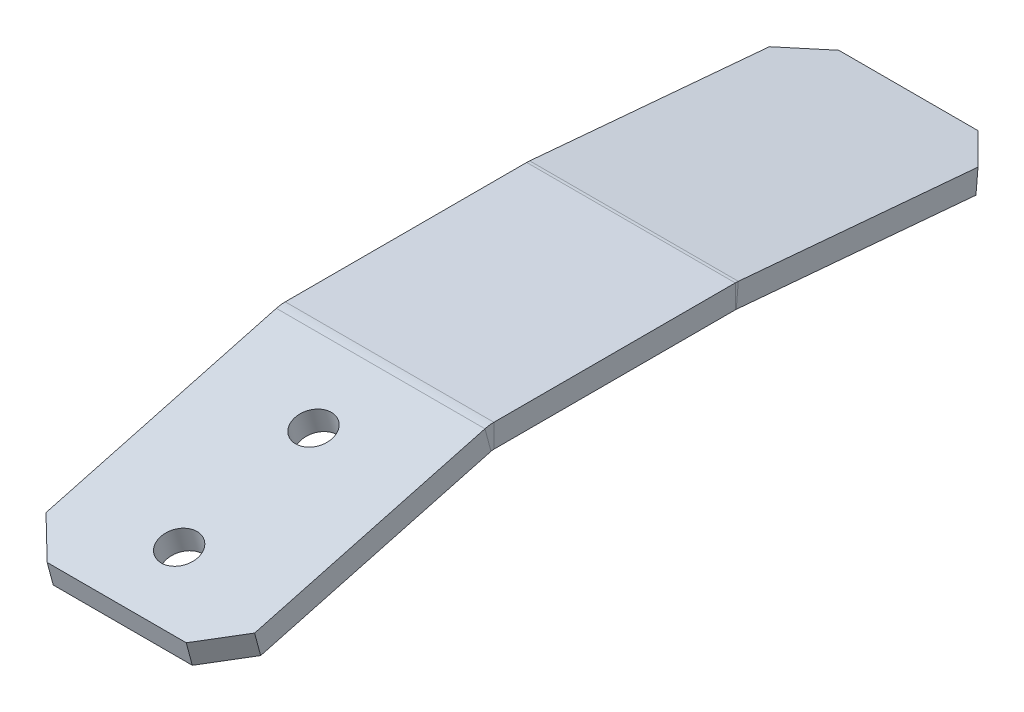
ISO-10303-21;
HEADER;
FILE_DESCRIPTION(('STEP AP214'),'2;1');
FILE_NAME('part.step','',(''),(''),'','','');
FILE_SCHEMA(('AUTOMOTIVE_DESIGN { 1 0 10303 214 1 1 1 1 }'));
ENDSEC;
DATA;
#1=APPLICATION_CONTEXT('core data for automotive mechanical design processes');
#2=APPLICATION_PROTOCOL_DEFINITION('international standard','automotive_design',2000,#1);
#3=PRODUCT_CONTEXT('',#1,'mechanical');
#4=PRODUCT('Part','Part','',(#3));
#5=PRODUCT_RELATED_PRODUCT_CATEGORY('part','',(#4));
#6=PRODUCT_DEFINITION_FORMATION('','',#4);
#7=PRODUCT_DEFINITION_CONTEXT('part definition',#1,'design');
#8=PRODUCT_DEFINITION('design','',#6,#7);
#9=PRODUCT_DEFINITION_SHAPE('','',#8);
#10=(LENGTH_UNIT() NAMED_UNIT(*) SI_UNIT(.MILLI.,.METRE.));
#11=(NAMED_UNIT(*) PLANE_ANGLE_UNIT() SI_UNIT($,.RADIAN.));
#12=(NAMED_UNIT(*) SI_UNIT($,.STERADIAN.) SOLID_ANGLE_UNIT());
#13=UNCERTAINTY_MEASURE_WITH_UNIT(LENGTH_MEASURE(1.E-05),#10,'distance_accuracy_value','');
#14=(GEOMETRIC_REPRESENTATION_CONTEXT(3) GLOBAL_UNCERTAINTY_ASSIGNED_CONTEXT((#13)) GLOBAL_UNIT_ASSIGNED_CONTEXT((#10,
#11,#12)) REPRESENTATION_CONTEXT('',''));
#15=CARTESIAN_POINT('',(0.,0.,0.));
#16=DIRECTION('',(0.,0.,1.));
#17=DIRECTION('',(1.,0.,0.));
#18=AXIS2_PLACEMENT_3D('',#15,#16,#17);
#19=CARTESIAN_POINT('',(0.,-4.2672,0.));
#20=DIRECTION('',(0.,-1.,0.));
#21=DIRECTION('',(0.,0.,-1.));
#22=AXIS2_PLACEMENT_3D('',#19,#20,#21);
#23=PLANE('',#22);
#24=DIRECTION('',(0.,0.,1.));
#25=VECTOR('',#24,1.);
#26=CARTESIAN_POINT('',(-19.0499999999999,-4.2672,-22.225));
#27=LINE('',#26,#25);
#28=CARTESIAN_POINT('',(-19.05,-4.2672,-22.1362809640099));
#29=VERTEX_POINT('',#28);
#30=CARTESIAN_POINT('',(-19.0499999999999,-4.2672,21.9574821249024));
#31=VERTEX_POINT('',#30);
#32=EDGE_CURVE('E262',#29,#31,#27,.T.);
#33=ORIENTED_EDGE('',*,*,#32,.F.);
#34=DIRECTION('',(1.,0.,0.));
#35=VECTOR('',#34,1.);
#36=CARTESIAN_POINT('',(19.05,-4.26719999999931,-22.1362809640099));
#37=LINE('',#36,#35);
#38=CARTESIAN_POINT('',(19.05,-4.26719999999931,-22.1362809640099));
#39=VERTEX_POINT('',#38);
#40=EDGE_CURVE('E202',#39,#29,#37,.F.);
#41=ORIENTED_EDGE('',*,*,#40,.F.);
#42=DIRECTION('',(0.,0.,-1.));
#43=VECTOR('',#42,1.);
#44=CARTESIAN_POINT('',(19.05,-4.2672,-22.225));
#45=LINE('',#44,#43);
#46=CARTESIAN_POINT('',(19.05,-4.2672,21.9574821249024));
#47=VERTEX_POINT('',#46);
#48=EDGE_CURVE('E264',#47,#39,#45,.T.);
#49=ORIENTED_EDGE('',*,*,#48,.F.);
#50=DIRECTION('',(-1.,0.,0.));
#51=VECTOR('',#50,1.);
#52=CARTESIAN_POINT('',(-19.05,-4.26720000000008,21.9574821249024));
#53=LINE('',#52,#51);
#54=EDGE_CURVE('E251',#31,#47,#53,.F.);
#55=ORIENTED_EDGE('',*,*,#54,.F.);
#56=EDGE_LOOP('',(#33,#41,#49,#55));
#57=FACE_BOUND('',#56,.T.);
#58=ADVANCED_FACE('F38',(#57),#23,.T.);
#59=CARTESIAN_POINT('',(0.,0.,0.));
#60=DIRECTION('',(0.,-1.,0.));
#61=DIRECTION('',(0.,0.,-1.));
#62=AXIS2_PLACEMENT_3D('',#59,#60,#61);
#63=PLANE('',#62);
#64=DIRECTION('',(1.,0.,0.));
#65=VECTOR('',#64,1.);
#66=CARTESIAN_POINT('',(19.0499999999999,6.86950496486816E-13,-22.1362809640099));
#67=LINE('',#66,#65);
#68=CARTESIAN_POINT('',(19.0499999999999,6.86950496486816E-13,-22.1362809640099));
#69=VERTEX_POINT('',#68);
#70=CARTESIAN_POINT('',(-19.05,0.,-22.1362809640099));
#71=VERTEX_POINT('',#70);
#72=EDGE_CURVE('E163',#69,#71,#67,.F.);
#73=ORIENTED_EDGE('',*,*,#72,.T.);
#74=DIRECTION('',(0.,0.,1.));
#75=VECTOR('',#74,1.);
#76=CARTESIAN_POINT('',(-19.0499999999999,0.,-22.225));
#77=LINE('',#76,#75);
#78=CARTESIAN_POINT('',(-19.05,0.,21.9574821249024));
#79=VERTEX_POINT('',#78);
#80=EDGE_CURVE('E259',#71,#79,#77,.T.);
#81=ORIENTED_EDGE('',*,*,#80,.T.);
#82=DIRECTION('',(-1.,0.,0.));
#83=VECTOR('',#82,1.);
#84=CARTESIAN_POINT('',(-19.05,0.,21.9574821249024));
#85=LINE('',#84,#83);
#86=CARTESIAN_POINT('',(19.05,0.,21.9574821249024));
#87=VERTEX_POINT('',#86);
#88=EDGE_CURVE('E239',#79,#87,#85,.F.);
#89=ORIENTED_EDGE('',*,*,#88,.T.);
#90=DIRECTION('',(0.,0.,-1.));
#91=VECTOR('',#90,1.);
#92=CARTESIAN_POINT('',(19.05,0.,-22.225));
#93=LINE('',#92,#91);
#94=EDGE_CURVE('E265',#87,#69,#93,.T.);
#95=ORIENTED_EDGE('',*,*,#94,.T.);
#96=EDGE_LOOP('',(#73,#81,#89,#95));
#97=FACE_BOUND('',#96,.T.);
#98=ADVANCED_FACE('F407',(#97),#63,.F.);
#99=CARTESIAN_POINT('',(19.05,-4.2672,-22.225));
#100=DIRECTION('',(1.,0.,0.));
#101=DIRECTION('',(0.,0.,-1.));
#102=AXIS2_PLACEMENT_3D('',#99,#100,#101);
#103=PLANE('',#102);
#104=ORIENTED_EDGE('',*,*,#48,.T.);
#105=DIRECTION('',(0.,1.,0.));
#106=VECTOR('',#105,1.);
#107=CARTESIAN_POINT('',(19.05,-4.26719999999931,-22.1362809640099));
#108=LINE('',#107,#106);
#109=EDGE_CURVE('E198',#39,#69,#108,.T.);
#110=ORIENTED_EDGE('',*,*,#109,.T.);
#111=ORIENTED_EDGE('',*,*,#94,.F.);
#112=DIRECTION('',(0.,1.,0.));
#113=VECTOR('',#112,1.);
#114=CARTESIAN_POINT('',(19.0500000000001,-4.2672,21.9574821249024));
#115=LINE('',#114,#113);
#116=EDGE_CURVE('E256',#47,#87,#115,.T.);
#117=ORIENTED_EDGE('',*,*,#116,.F.);
#118=EDGE_LOOP('',(#104,#110,#111,#117));
#119=FACE_BOUND('',#118,.T.);
#120=ADVANCED_FACE('F391',(#119),#103,.T.);
#121=CARTESIAN_POINT('',(-19.0499999999999,-4.2672,-22.225));
#122=DIRECTION('',(-1.,0.,0.));
#123=DIRECTION('',(0.,0.,1.));
#124=AXIS2_PLACEMENT_3D('',#121,#122,#123);
#125=PLANE('',#124);
#126=DIRECTION('',(0.,1.,0.));
#127=VECTOR('',#126,1.);
#128=CARTESIAN_POINT('',(-19.05,-4.2672,-22.1362809640099));
#129=LINE('',#128,#127);
#130=EDGE_CURVE('E206',#29,#71,#129,.T.);
#131=ORIENTED_EDGE('',*,*,#130,.F.);
#132=ORIENTED_EDGE('',*,*,#32,.T.);
#133=DIRECTION('',(0.,1.,0.));
#134=VECTOR('',#133,1.);
#135=CARTESIAN_POINT('',(-19.05,-4.26720000000008,21.9574821249024));
#136=LINE('',#135,#134);
#137=EDGE_CURVE('E245',#31,#79,#136,.T.);
#138=ORIENTED_EDGE('',*,*,#137,.T.);
#139=ORIENTED_EDGE('',*,*,#80,.F.);
#140=EDGE_LOOP('',(#131,#132,#138,#139));
#141=FACE_BOUND('',#140,.T.);
#142=ADVANCED_FACE('F386',(#141),#125,.T.);
#143=CARTESIAN_POINT('',(19.0500000000001,-6.29919999999995,21.9574821249024));
#144=DIRECTION('',(1.,0.,0.));
#145=DIRECTION('',(0.,1.,0.));
#146=AXIS2_PLACEMENT_3D('',#143,#144,#145);
#147=PLANE('',#146);
#148=DIRECTION('',(0.,0.96592582628907,0.258819045102514));
#149=VECTOR('',#148,1.);
#150=CARTESIAN_POINT('',(19.0500000000001,-4.33643872098061,22.4834024245507));
#151=LINE('',#150,#149);
#152=CARTESIAN_POINT('',(19.0500000000001,-4.33643872098061,22.4834024245507));
#153=VERTEX_POINT('',#152);
#154=CARTESIAN_POINT('',(19.0500000000001,-0.21464003503989,23.5878350538121));
#155=VERTEX_POINT('',#154);
#156=EDGE_CURVE('E209',#153,#155,#151,.T.);
#157=ORIENTED_EDGE('',*,*,#156,.F.);
#158=CARTESIAN_POINT('',(19.0500000000001,-6.29919999999995,21.9574821249024));
#159=DIRECTION('',(-1.,0.,0.));
#160=DIRECTION('',(0.,-1.,0.));
#161=AXIS2_PLACEMENT_3D('',#158,#159,#160);
#162=CIRCLE('',#161,2.03199999999994);
#163=EDGE_CURVE('E248',#47,#153,#162,.F.);
#164=ORIENTED_EDGE('',*,*,#163,.F.);
#165=ORIENTED_EDGE('',*,*,#116,.T.);
#166=CARTESIAN_POINT('',(19.0500000000001,-6.29919999999995,21.9574821249024));
#167=DIRECTION('',(-1.,0.,0.));
#168=DIRECTION('',(0.,-1.,0.));
#169=AXIS2_PLACEMENT_3D('',#166,#167,#168);
#170=CIRCLE('',#169,6.29919999999994);
#171=EDGE_CURVE('E241',#87,#155,#170,.F.);
#172=ORIENTED_EDGE('',*,*,#171,.T.);
#173=EDGE_LOOP('',(#157,#164,#165,#172));
#174=FACE_BOUND('',#173,.T.);
#175=ADVANCED_FACE('F363',(#174),#147,.T.);
#176=CARTESIAN_POINT('',(-19.05,-6.29920000000003,21.9574821249024));
#177=DIRECTION('',(1.,0.,0.));
#178=DIRECTION('',(0.,1.,0.));
#179=AXIS2_PLACEMENT_3D('',#176,#177,#178);
#180=PLANE('',#179);
#181=CARTESIAN_POINT('',(-19.05,-6.29920000000003,21.9574821249024));
#182=DIRECTION('',(-1.,0.,0.));
#183=DIRECTION('',(0.,-1.,0.));
#184=AXIS2_PLACEMENT_3D('',#181,#182,#183);
#185=CIRCLE('',#184,2.03199999999994);
#186=CARTESIAN_POINT('',(-19.05,-4.33643872098069,22.4834024245507));
#187=VERTEX_POINT('',#186);
#188=EDGE_CURVE('E232',#187,#31,#185,.T.);
#189=ORIENTED_EDGE('',*,*,#188,.F.);
#190=DIRECTION('',(0.,0.96592582628907,0.258819045102514));
#191=VECTOR('',#190,1.);
#192=CARTESIAN_POINT('',(-19.05,-4.33643872098062,22.4834024245507));
#193=LINE('',#192,#191);
#194=CARTESIAN_POINT('',(-19.05,-0.214640035039896,23.5878350538122));
#195=VERTEX_POINT('',#194);
#196=EDGE_CURVE('E214',#187,#195,#193,.T.);
#197=ORIENTED_EDGE('',*,*,#196,.T.);
#198=CARTESIAN_POINT('',(-19.05,-6.29920000000003,21.9574821249024));
#199=DIRECTION('',(-1.,0.,0.));
#200=DIRECTION('',(0.,-1.,0.));
#201=AXIS2_PLACEMENT_3D('',#198,#199,#200);
#202=CIRCLE('',#201,6.29919999999994);
#203=EDGE_CURVE('E242',#195,#79,#202,.T.);
#204=ORIENTED_EDGE('',*,*,#203,.T.);
#205=ORIENTED_EDGE('',*,*,#137,.F.);
#206=EDGE_LOOP('',(#189,#197,#204,#205));
#207=FACE_BOUND('',#206,.T.);
#208=ADVANCED_FACE('F383',(#207),#180,.F.);
#209=CARTESIAN_POINT('',(-19.05,-6.29920000000003,21.9574821249024));
#210=DIRECTION('',(-1.,0.,0.));
#211=DIRECTION('',(0.,0.96592582628907,0.258819045102515));
#212=AXIS2_PLACEMENT_3D('',#209,#210,#211);
#213=CYLINDRICAL_SURFACE('',#212,6.29919999999994);
#214=ORIENTED_EDGE('',*,*,#88,.F.);
#215=ORIENTED_EDGE('',*,*,#203,.F.);
#216=DIRECTION('',(1.,0.,0.));
#217=VECTOR('',#216,1.);
#218=CARTESIAN_POINT('',(0.,-0.214640035039892,23.5878350538122));
#219=LINE('',#218,#217);
#220=EDGE_CURVE('E217',#195,#155,#219,.T.);
#221=ORIENTED_EDGE('',*,*,#220,.T.);
#222=ORIENTED_EDGE('',*,*,#171,.F.);
#223=EDGE_LOOP('',(#214,#215,#221,#222));
#224=FACE_BOUND('',#223,.T.);
#225=ADVANCED_FACE('F380',(#224),#213,.T.);
#226=CARTESIAN_POINT('',(-19.05,-6.29920000000003,21.9574821249024));
#227=DIRECTION('',(-1.,0.,0.));
#228=DIRECTION('',(0.,0.96592582628907,0.258819045102515));
#229=AXIS2_PLACEMENT_3D('',#226,#227,#228);
#230=CYLINDRICAL_SURFACE('',#229,2.03199999999994);
#231=ORIENTED_EDGE('',*,*,#54,.T.);
#232=ORIENTED_EDGE('',*,*,#163,.T.);
#233=DIRECTION('',(-1.,0.,0.));
#234=VECTOR('',#233,1.);
#235=CARTESIAN_POINT('',(19.0500000000001,-4.33643872098061,22.4834024245507));
#236=LINE('',#235,#234);
#237=EDGE_CURVE('E212',#153,#187,#236,.T.);
#238=ORIENTED_EDGE('',*,*,#237,.T.);
#239=ORIENTED_EDGE('',*,*,#188,.T.);
#240=EDGE_LOOP('',(#231,#232,#238,#239));
#241=FACE_BOUND('',#240,.T.);
#242=ADVANCED_FACE('F367',(#241),#230,.F.);
#243=CARTESIAN_POINT('',(-19.05,-0.14540131405928,23.3294326292614));
#244=DIRECTION('',(1.,0.,0.));
#245=DIRECTION('',(0.,0.,-1.));
#246=AXIS2_PLACEMENT_3D('',#243,#244,#245);
#247=PLANE('',#246);
#248=DIRECTION('',(0.,-0.258819045102515,0.96592582628907));
#249=VECTOR('',#248,1.);
#250=CARTESIAN_POINT('',(-19.05,-4.2672,22.225));
#251=LINE('',#250,#249);
#252=CARTESIAN_POINT('',(-19.05,-15.6094283025085,64.5547722960084));
#253=VERTEX_POINT('',#252);
#254=EDGE_CURVE('E222',#187,#253,#251,.T.);
#255=ORIENTED_EDGE('',*,*,#254,.T.);
#256=DIRECTION('',(0.,0.96592582628907,0.258819045102515));
#257=VECTOR('',#256,1.);
#258=CARTESIAN_POINT('',(-19.05,-11.4876296165678,65.6592049252698));
#259=LINE('',#258,#257);
#260=CARTESIAN_POINT('',(-19.05,-11.4876296165678,65.6592049252698));
#261=VERTEX_POINT('',#260);
#262=EDGE_CURVE('E279',#253,#261,#259,.T.);
#263=ORIENTED_EDGE('',*,*,#262,.T.);
#264=DIRECTION('',(0.,-0.258819045102515,0.96592582628907));
#265=VECTOR('',#264,1.);
#266=CARTESIAN_POINT('',(-19.05,-0.14540131405928,23.3294326292614));
#267=LINE('',#266,#265);
#268=EDGE_CURVE('E223',#195,#261,#267,.T.);
#269=ORIENTED_EDGE('',*,*,#268,.F.);
#270=ORIENTED_EDGE('',*,*,#196,.F.);
#271=EDGE_LOOP('',(#255,#263,#269,#270));
#272=FACE_BOUND('',#271,.T.);
#273=ADVANCED_FACE('F373',(#272),#247,.F.);
#274=CARTESIAN_POINT('',(19.0500000000001,-0.145401314059278,23.3294326292614));
#275=DIRECTION('',(-1.,0.,0.));
#276=DIRECTION('',(0.,0.,1.));
#277=AXIS2_PLACEMENT_3D('',#274,#275,#276);
#278=PLANE('',#277);
#279=DIRECTION('',(0.,0.258819045102515,-0.96592582628907));
#280=VECTOR('',#279,1.);
#281=CARTESIAN_POINT('',(19.0500000000001,-0.145401314059278,23.3294326292614));
#282=LINE('',#281,#280);
#283=CARTESIAN_POINT('',(19.05,-11.4876296165677,65.6592049252698));
#284=VERTEX_POINT('',#283);
#285=EDGE_CURVE('E230',#284,#155,#282,.T.);
#286=ORIENTED_EDGE('',*,*,#285,.F.);
#287=DIRECTION('',(0.,-0.96592582628907,-0.258819045102515));
#288=VECTOR('',#287,1.);
#289=CARTESIAN_POINT('',(19.05,-11.4876296165678,65.6592049252698));
#290=LINE('',#289,#288);
#291=CARTESIAN_POINT('',(19.05,-15.6094283025085,64.5547722960084));
#292=VERTEX_POINT('',#291);
#293=EDGE_CURVE('E11',#284,#292,#290,.T.);
#294=ORIENTED_EDGE('',*,*,#293,.T.);
#295=DIRECTION('',(0.,0.258819045102515,-0.96592582628907));
#296=VECTOR('',#295,1.);
#297=CARTESIAN_POINT('',(19.0500000000001,-4.2672,22.225));
#298=LINE('',#297,#296);
#299=EDGE_CURVE('E227',#292,#153,#298,.T.);
#300=ORIENTED_EDGE('',*,*,#299,.T.);
#301=ORIENTED_EDGE('',*,*,#156,.T.);
#302=EDGE_LOOP('',(#286,#294,#300,#301));
#303=FACE_BOUND('',#302,.T.);
#304=ADVANCED_FACE('F359',(#303),#278,.F.);
#305=CARTESIAN_POINT('',(0.,5.6966968844261,1.52642532970683));
#306=DIRECTION('',(0.,-0.96592582628907,-0.258819045102515));
#307=DIRECTION('',(0.,0.258819045102515,-0.96592582628907));
#308=AXIS2_PLACEMENT_3D('',#305,#306,#307);
#309=PLANE('',#308);
#310=CARTESIAN_POINT('',(0.,-3.50164190784186,35.8550930476835));
#311=DIRECTION('',(0.,0.96592582628907,0.258819045102515));
#312=DIRECTION('',(0.,-0.258819045102515,0.96592582628907));
#313=AXIS2_PLACEMENT_3D('',#310,#311,#312);
#314=CIRCLE('',#313,3.373501);
#315=CARTESIAN_POINT('',(0.,-4.37476821531424,39.1136447885955));
#316=VERTEX_POINT('',#315);
#317=EDGE_CURVE('E328',#316,#316,#314,.T.);
#318=ORIENTED_EDGE('',*,*,#317,.F.);
#319=EDGE_LOOP('',(#318));
#320=FACE_BOUND('',#319,.T.);
#321=CARTESIAN_POINT('',(0.,-10.0756456534457,60.3896090354258));
#322=DIRECTION('',(0.,0.96592582628907,0.258819045102515));
#323=DIRECTION('',(0.,-0.258819045102515,0.96592582628907));
#324=AXIS2_PLACEMENT_3D('',#321,#322,#323);
#325=CIRCLE('',#324,3.373501);
#326=CARTESIAN_POINT('',(0.,-10.9487719609181,63.6481607763379));
#327=VERTEX_POINT('',#326);
#328=EDGE_CURVE('E325',#327,#327,#325,.T.);
#329=ORIENTED_EDGE('',*,*,#328,.F.);
#330=EDGE_LOOP('',(#329));
#331=FACE_BOUND('',#330,.T.);
#332=ORIENTED_EDGE('',*,*,#268,.T.);
#333=DIRECTION('',(-0.707106781186547,0.183012701892215,-0.683012701892221));
#334=VECTOR('',#333,1.);
#335=CARTESIAN_POINT('',(-12.7,-13.1311305529687,71.7928339222054));
#336=LINE('',#335,#334);
#337=CARTESIAN_POINT('',(-12.7,-13.1311305529687,71.7928339222054));
#338=VERTEX_POINT('',#337);
#339=EDGE_CURVE('E283',#261,#338,#336,.F.);
#340=ORIENTED_EDGE('',*,*,#339,.T.);
#341=DIRECTION('',(1.,0.,0.));
#342=VECTOR('',#341,1.);
#343=CARTESIAN_POINT('',(19.05,-13.1311305529687,71.7928339222054));
#344=LINE('',#343,#342);
#345=CARTESIAN_POINT('',(12.7,-13.1311305529687,71.7928339222054));
#346=VERTEX_POINT('',#345);
#347=EDGE_CURVE('E226',#338,#346,#344,.T.);
#348=ORIENTED_EDGE('',*,*,#347,.T.);
#349=DIRECTION('',(-0.707106781186551,-0.183012701892214,0.683012701892218));
#350=VECTOR('',#349,1.);
#351=CARTESIAN_POINT('',(19.05,-11.4876296165678,65.6592049252698));
#352=LINE('',#351,#350);
#353=EDGE_CURVE('E281',#346,#284,#352,.F.);
#354=ORIENTED_EDGE('',*,*,#353,.T.);
#355=ORIENTED_EDGE('',*,*,#285,.T.);
#356=ORIENTED_EDGE('',*,*,#220,.F.);
#357=EDGE_LOOP('',(#332,#340,#348,#354,#355,#356));
#358=FACE_BOUND('',#357,.T.);
#359=ADVANCED_FACE('F341',(#320,#331,#358),#309,.F.);
#360=CARTESIAN_POINT('',(0.,1.57489819848537,0.421992700445375));
#361=DIRECTION('',(0.,-0.96592582628907,-0.258819045102515));
#362=DIRECTION('',(0.,0.258819045102515,-0.96592582628907));
#363=AXIS2_PLACEMENT_3D('',#360,#361,#362);
#364=PLANE('',#363);
#365=CARTESIAN_POINT('',(0.,-7.62344059378258,34.750660418422));
#366=DIRECTION('',(0.,-0.96592582628907,-0.258819045102515));
#367=DIRECTION('',(0.,0.258819045102515,-0.96592582628907));
#368=AXIS2_PLACEMENT_3D('',#365,#366,#367);
#369=CIRCLE('',#368,3.37350099999999);
#370=CARTESIAN_POINT('',(0.,-6.7503142863102,31.49210867751));
#371=VERTEX_POINT('',#370);
#372=EDGE_CURVE('E42',#371,#371,#369,.T.);
#373=ORIENTED_EDGE('',*,*,#372,.F.);
#374=EDGE_LOOP('',(#373));
#375=FACE_BOUND('',#374,.T.);
#376=CARTESIAN_POINT('',(0.,-14.1974443393864,59.2851764061644));
#377=DIRECTION('',(0.,-0.96592582628907,-0.258819045102515));
#378=DIRECTION('',(0.,0.258819045102515,-0.96592582628907));
#379=AXIS2_PLACEMENT_3D('',#376,#377,#378);
#380=CIRCLE('',#379,3.37350099999999);
#381=CARTESIAN_POINT('',(0.,-13.3243180319141,56.0266246652524));
#382=VERTEX_POINT('',#381);
#383=EDGE_CURVE('E320',#382,#382,#380,.T.);
#384=ORIENTED_EDGE('',*,*,#383,.F.);
#385=EDGE_LOOP('',(#384));
#386=FACE_BOUND('',#385,.T.);
#387=DIRECTION('',(1.,0.,0.));
#388=VECTOR('',#387,1.);
#389=CARTESIAN_POINT('',(19.05,-17.2529292389094,70.688401292944));
#390=LINE('',#389,#388);
#391=CARTESIAN_POINT('',(-12.7,-17.2529292389094,70.688401292944));
#392=VERTEX_POINT('',#391);
#393=CARTESIAN_POINT('',(12.7,-17.2529292389094,70.688401292944));
#394=VERTEX_POINT('',#393);
#395=EDGE_CURVE('E235',#392,#394,#390,.T.);
#396=ORIENTED_EDGE('',*,*,#395,.F.);
#397=DIRECTION('',(0.707106781186547,-0.183012701892215,0.683012701892221));
#398=VECTOR('',#397,1.);
#399=CARTESIAN_POINT('',(-42.722569549388,-9.48251645661299,41.6888259936302));
#400=LINE('',#399,#398);
#401=EDGE_CURVE('E277',#392,#253,#400,.F.);
#402=ORIENTED_EDGE('',*,*,#401,.T.);
#403=ORIENTED_EDGE('',*,*,#254,.F.);
#404=ORIENTED_EDGE('',*,*,#237,.F.);
#405=ORIENTED_EDGE('',*,*,#299,.F.);
#406=DIRECTION('',(0.707106781186551,0.183012701892214,-0.683012701892218));
#407=VECTOR('',#406,1.);
#408=CARTESIAN_POINT('',(42.722569549388,-9.48251645661307,41.6888259936305));
#409=LINE('',#408,#407);
#410=EDGE_CURVE('E275',#292,#394,#409,.F.);
#411=ORIENTED_EDGE('',*,*,#410,.T.);
#412=EDGE_LOOP('',(#396,#402,#403,#404,#405,#411));
#413=FACE_BOUND('',#412,.T.);
#414=ADVANCED_FACE('F337',(#375,#386,#413),#364,.T.);
#415=CARTESIAN_POINT('',(19.05,-13.1311305529687,71.7928339222054));
#416=DIRECTION('',(0.,0.258819045102515,-0.96592582628907));
#417=DIRECTION('',(0.,0.96592582628907,0.258819045102515));
#418=AXIS2_PLACEMENT_3D('',#415,#416,#417);
#419=PLANE('',#418);
#420=ORIENTED_EDGE('',*,*,#347,.F.);
#421=DIRECTION('',(0.,-0.96592582628907,-0.258819045102515));
#422=VECTOR('',#421,1.);
#423=CARTESIAN_POINT('',(-12.7,-13.1311305529687,71.7928339222054));
#424=LINE('',#423,#422);
#425=EDGE_CURVE('E272',#338,#392,#424,.T.);
#426=ORIENTED_EDGE('',*,*,#425,.T.);
#427=ORIENTED_EDGE('',*,*,#395,.T.);
#428=DIRECTION('',(0.,0.96592582628907,0.258819045102515));
#429=VECTOR('',#428,1.);
#430=CARTESIAN_POINT('',(12.7,-13.1311305529687,71.7928339222054));
#431=LINE('',#430,#429);
#432=EDGE_CURVE('E268',#394,#346,#431,.T.);
#433=ORIENTED_EDGE('',*,*,#432,.T.);
#434=EDGE_LOOP('',(#420,#426,#427,#433));
#435=FACE_BOUND('',#434,.T.);
#436=ADVANCED_FACE('F340',(#435),#419,.F.);
#437=CARTESIAN_POINT('',(-19.05,-6.2992000000005,-22.1362809640099));
#438=DIRECTION('',(-1.,0.,0.));
#439=DIRECTION('',(0.,-1.,0.));
#440=AXIS2_PLACEMENT_3D('',#437,#438,#439);
#441=PLANE('',#440);
#442=DIRECTION('',(0.,0.996194698091746,-0.0871557427476516));
#443=VECTOR('',#442,1.);
#444=CARTESIAN_POINT('',(-19.05,-4.27493237347757,-22.3133814332732));
#445=LINE('',#444,#443);
#446=CARTESIAN_POINT('',(-19.05,-4.27493237347757,-22.3133814332732));
#447=VERTEX_POINT('',#446);
#448=CARTESIAN_POINT('',(-19.0500000000001,-0.0239703577804709,-22.6852924187259));
#449=VERTEX_POINT('',#448);
#450=EDGE_CURVE('E308',#447,#449,#445,.T.);
#451=ORIENTED_EDGE('',*,*,#450,.F.);
#452=CARTESIAN_POINT('',(-19.05,-6.2992000000005,-22.1362809640099));
#453=DIRECTION('',(1.,0.,0.));
#454=DIRECTION('',(0.,1.,0.));
#455=AXIS2_PLACEMENT_3D('',#452,#453,#454);
#456=CIRCLE('',#455,2.0320000000005);
#457=EDGE_CURVE('E166',#29,#447,#456,.F.);
#458=ORIENTED_EDGE('',*,*,#457,.F.);
#459=ORIENTED_EDGE('',*,*,#130,.T.);
#460=CARTESIAN_POINT('',(-19.05,-6.2992000000005,-22.1362809640099));
#461=DIRECTION('',(1.,0.,0.));
#462=DIRECTION('',(0.,1.,0.));
#463=AXIS2_PLACEMENT_3D('',#460,#461,#462);
#464=CIRCLE('',#463,6.2992000000005);
#465=EDGE_CURVE('E197',#71,#449,#464,.F.);
#466=ORIENTED_EDGE('',*,*,#465,.T.);
#467=EDGE_LOOP('',(#451,#458,#459,#466));
#468=FACE_BOUND('',#467,.T.);
#469=ADVANCED_FACE('F396',(#468),#441,.T.);
#470=CARTESIAN_POINT('',(19.05,-6.29919999999982,-22.1362809640099));
#471=DIRECTION('',(-1.,0.,0.));
#472=DIRECTION('',(0.,-1.,0.));
#473=AXIS2_PLACEMENT_3D('',#470,#471,#472);
#474=PLANE('',#473);
#475=CARTESIAN_POINT('',(19.05,-6.29919999999982,-22.1362809640099));
#476=DIRECTION('',(1.,0.,0.));
#477=DIRECTION('',(0.,1.,0.));
#478=AXIS2_PLACEMENT_3D('',#475,#476,#477);
#479=CIRCLE('',#478,2.0320000000005);
#480=CARTESIAN_POINT('',(19.05,-4.27493237347689,-22.3133814332732));
#481=VERTEX_POINT('',#480);
#482=EDGE_CURVE('E173',#481,#39,#479,.T.);
#483=ORIENTED_EDGE('',*,*,#482,.F.);
#484=DIRECTION('',(0.,0.996194698091746,-0.0871557427476516));
#485=VECTOR('',#484,1.);
#486=CARTESIAN_POINT('',(19.05,-4.27493237347757,-22.3133814332731));
#487=LINE('',#486,#485);
#488=CARTESIAN_POINT('',(19.05,-0.0239703577804666,-22.6852924187259));
#489=VERTEX_POINT('',#488);
#490=EDGE_CURVE('E170',#481,#489,#487,.T.);
#491=ORIENTED_EDGE('',*,*,#490,.T.);
#492=CARTESIAN_POINT('',(19.05,-6.29919999999982,-22.1362809640099));
#493=DIRECTION('',(1.,0.,0.));
#494=DIRECTION('',(0.,1.,0.));
#495=AXIS2_PLACEMENT_3D('',#492,#493,#494);
#496=CIRCLE('',#495,6.2992000000005);
#497=EDGE_CURVE('E156',#489,#69,#496,.T.);
#498=ORIENTED_EDGE('',*,*,#497,.T.);
#499=ORIENTED_EDGE('',*,*,#109,.F.);
#500=EDGE_LOOP('',(#483,#491,#498,#499));
#501=FACE_BOUND('',#500,.T.);
#502=ADVANCED_FACE('F171',(#501),#474,.F.);
#503=CARTESIAN_POINT('',(19.05,-6.29919999999982,-22.1362809640099));
#504=DIRECTION('',(1.,0.,0.));
#505=DIRECTION('',(0.,0.996194698091746,-0.0871557427476516));
#506=AXIS2_PLACEMENT_3D('',#503,#504,#505);
#507=CYLINDRICAL_SURFACE('',#506,6.2992000000005);
#508=ORIENTED_EDGE('',*,*,#72,.F.);
#509=ORIENTED_EDGE('',*,*,#497,.F.);
#510=DIRECTION('',(-1.,0.,0.));
#511=VECTOR('',#510,1.);
#512=CARTESIAN_POINT('',(0.,-0.0239703577804692,-22.6852924187259));
#513=LINE('',#512,#511);
#514=EDGE_CURVE('E161',#489,#449,#513,.T.);
#515=ORIENTED_EDGE('',*,*,#514,.T.);
#516=ORIENTED_EDGE('',*,*,#465,.F.);
#517=EDGE_LOOP('',(#508,#509,#515,#516));
#518=FACE_BOUND('',#517,.T.);
#519=ADVANCED_FACE('F158',(#518),#507,.T.);
#520=CARTESIAN_POINT('',(19.05,-6.29919999999982,-22.1362809640099));
#521=DIRECTION('',(1.,0.,0.));
#522=DIRECTION('',(0.,0.996194698091746,-0.0871557427476516));
#523=AXIS2_PLACEMENT_3D('',#520,#521,#522);
#524=CYLINDRICAL_SURFACE('',#523,2.0320000000005);
#525=ORIENTED_EDGE('',*,*,#40,.T.);
#526=ORIENTED_EDGE('',*,*,#457,.T.);
#527=DIRECTION('',(1.,0.,0.));
#528=VECTOR('',#527,1.);
#529=CARTESIAN_POINT('',(-19.05,-4.27493237347757,-22.3133814332732));
#530=LINE('',#529,#528);
#531=EDGE_CURVE('E175',#447,#481,#530,.T.);
#532=ORIENTED_EDGE('',*,*,#531,.T.);
#533=ORIENTED_EDGE('',*,*,#482,.T.);
#534=EDGE_LOOP('',(#525,#526,#532,#533));
#535=FACE_BOUND('',#534,.T.);
#536=ADVANCED_FACE('F393',(#535),#524,.F.);
#537=CARTESIAN_POINT('',(-19.05,-4.40743498924534,-72.7885224236777));
#538=DIRECTION('',(1.,0.,0.));
#539=DIRECTION('',(0.,0.,-1.));
#540=AXIS2_PLACEMENT_3D('',#537,#538,#539);
#541=PLANE('',#540);
#542=DIRECTION('',(0.,0.0871557427476516,0.996194698091746));
#543=VECTOR('',#542,1.);
#544=CARTESIAN_POINT('',(-19.05,-4.40743498924534,-72.7885224236777));
#545=LINE('',#544,#543);
#546=CARTESIAN_POINT('',(-19.05,-3.85399602279776,-66.4626860907951));
#547=VERTEX_POINT('',#546);
#548=EDGE_CURVE('E182',#547,#449,#545,.T.);
#549=ORIENTED_EDGE('',*,*,#548,.F.);
#550=DIRECTION('',(0.,-0.996194698091746,0.0871557427476516));
#551=VECTOR('',#550,1.);
#552=CARTESIAN_POINT('',(-19.05,-3.85399602279776,-66.4626860907951));
#553=LINE('',#552,#551);
#554=CARTESIAN_POINT('',(-19.05,-8.10495803849486,-66.0907751053424));
#555=VERTEX_POINT('',#554);
#556=EDGE_CURVE('E285',#547,#555,#553,.T.);
#557=ORIENTED_EDGE('',*,*,#556,.T.);
#558=DIRECTION('',(0.,0.0871557427476516,0.996194698091746));
#559=VECTOR('',#558,1.);
#560=CARTESIAN_POINT('',(-19.05,-8.65839700494244,-72.4166114382249));
#561=LINE('',#560,#559);
#562=EDGE_CURVE('E183',#555,#447,#561,.T.);
#563=ORIENTED_EDGE('',*,*,#562,.T.);
#564=ORIENTED_EDGE('',*,*,#450,.T.);
#565=EDGE_LOOP('',(#549,#557,#563,#564));
#566=FACE_BOUND('',#565,.T.);
#567=ADVANCED_FACE('F305',(#566),#541,.F.);
#568=CARTESIAN_POINT('',(19.05,-4.40743498924534,-72.7885224236777));
#569=DIRECTION('',(-1.,0.,0.));
#570=DIRECTION('',(0.,0.,1.));
#571=AXIS2_PLACEMENT_3D('',#568,#569,#570);
#572=PLANE('',#571);
#573=DIRECTION('',(0.,-0.0871557427476515,-0.996194698091746));
#574=VECTOR('',#573,1.);
#575=CARTESIAN_POINT('',(19.05,-8.65839700494244,-72.4166114382249));
#576=LINE('',#575,#574);
#577=CARTESIAN_POINT('',(19.05,-8.10495803849486,-66.0907751053424));
#578=VERTEX_POINT('',#577);
#579=EDGE_CURVE('E193',#481,#578,#576,.T.);
#580=ORIENTED_EDGE('',*,*,#579,.T.);
#581=DIRECTION('',(0.,0.996194698091746,-0.0871557427476515));
#582=VECTOR('',#581,1.);
#583=CARTESIAN_POINT('',(19.05,-3.85399602279776,-66.4626860907952));
#584=LINE('',#583,#582);
#585=CARTESIAN_POINT('',(19.05,-3.85399602279776,-66.4626860907952));
#586=VERTEX_POINT('',#585);
#587=EDGE_CURVE('E47',#578,#586,#584,.T.);
#588=ORIENTED_EDGE('',*,*,#587,.T.);
#589=DIRECTION('',(0.,-0.0871557427476515,-0.996194698091746));
#590=VECTOR('',#589,1.);
#591=CARTESIAN_POINT('',(19.05,-4.40743498924534,-72.7885224236777));
#592=LINE('',#591,#590);
#593=EDGE_CURVE('E179',#489,#586,#592,.T.);
#594=ORIENTED_EDGE('',*,*,#593,.F.);
#595=ORIENTED_EDGE('',*,*,#490,.F.);
#596=EDGE_LOOP('',(#580,#588,#594,#595));
#597=FACE_BOUND('',#596,.T.);
#598=ADVANCED_FACE('F185',(#597),#572,.F.);
#599=CARTESIAN_POINT('',(0.,1.94584156819387,-0.170239078234457));
#600=DIRECTION('',(0.,-0.996194698091746,0.0871557427476516));
#601=DIRECTION('',(0.,-0.0871557427476516,-0.996194698091746));
#602=AXIS2_PLACEMENT_3D('',#599,#600,#601);
#603=PLANE('',#602);
#604=DIRECTION('',(-1.,0.,0.));
#605=VECTOR('',#604,1.);
#606=CARTESIAN_POINT('',(-19.05,-4.40743498924534,-72.7885224236777));
#607=LINE('',#606,#605);
#608=CARTESIAN_POINT('',(12.7,-4.40743498924534,-72.7885224236777));
#609=VERTEX_POINT('',#608);
#610=CARTESIAN_POINT('',(-12.7,-4.40743498924534,-72.7885224236777));
#611=VERTEX_POINT('',#610);
#612=EDGE_CURVE('E186',#609,#611,#607,.T.);
#613=ORIENTED_EDGE('',*,*,#612,.T.);
#614=DIRECTION('',(0.707106781186549,-0.0616284167162146,-0.704416026402758));
#615=VECTOR('',#614,1.);
#616=CARTESIAN_POINT('',(-19.05,-3.85399602279776,-66.4626860907951));
#617=LINE('',#616,#615);
#618=EDGE_CURVE('E298',#611,#547,#617,.F.);
#619=ORIENTED_EDGE('',*,*,#618,.T.);
#620=ORIENTED_EDGE('',*,*,#548,.T.);
#621=ORIENTED_EDGE('',*,*,#514,.F.);
#622=ORIENTED_EDGE('',*,*,#593,.T.);
#623=DIRECTION('',(0.707106781186547,0.0616284167162148,0.70441602640276));
#624=VECTOR('',#623,1.);
#625=CARTESIAN_POINT('',(12.7,-4.40743498924534,-72.7885224236777));
#626=LINE('',#625,#624);
#627=EDGE_CURVE('E296',#586,#609,#626,.F.);
#628=ORIENTED_EDGE('',*,*,#627,.T.);
#629=EDGE_LOOP('',(#613,#619,#620,#621,#622,#628));
#630=FACE_BOUND('',#629,.T.);
#631=ADVANCED_FACE('F178',(#630),#603,.F.);
#632=CARTESIAN_POINT('',(0.,-2.30512044750323,0.201671907218322));
#633=DIRECTION('',(0.,-0.996194698091746,0.0871557427476516));
#634=DIRECTION('',(0.,-0.0871557427476516,-0.996194698091746));
#635=AXIS2_PLACEMENT_3D('',#632,#633,#634);
#636=PLANE('',#635);
#637=ORIENTED_EDGE('',*,*,#562,.F.);
#638=DIRECTION('',(-0.707106781186549,0.0616284167162146,0.704416026402758));
#639=VECTOR('',#638,1.);
#640=CARTESIAN_POINT('',(-42.7978366952498,-6.03519769267044,-42.4333060983861));
#641=LINE('',#640,#639);
#642=CARTESIAN_POINT('',(-12.7,-8.65839700494244,-72.4166114382249));
#643=VERTEX_POINT('',#642);
#644=EDGE_CURVE('E290',#555,#643,#641,.F.);
#645=ORIENTED_EDGE('',*,*,#644,.T.);
#646=DIRECTION('',(-1.,0.,0.));
#647=VECTOR('',#646,1.);
#648=CARTESIAN_POINT('',(-19.05,-8.65839700494244,-72.4166114382249));
#649=LINE('',#648,#647);
#650=CARTESIAN_POINT('',(12.7,-8.65839700494244,-72.4166114382249));
#651=VERTEX_POINT('',#650);
#652=EDGE_CURVE('E189',#651,#643,#649,.T.);
#653=ORIENTED_EDGE('',*,*,#652,.F.);
#654=DIRECTION('',(-0.707106781186547,-0.0616284167162148,-0.70441602640276));
#655=VECTOR('',#654,1.);
#656=CARTESIAN_POINT('',(42.7978366952498,-6.03519769267042,-42.4333060983858));
#657=LINE('',#656,#655);
#658=EDGE_CURVE('E288',#651,#578,#657,.F.);
#659=ORIENTED_EDGE('',*,*,#658,.T.);
#660=ORIENTED_EDGE('',*,*,#579,.F.);
#661=ORIENTED_EDGE('',*,*,#531,.F.);
#662=EDGE_LOOP('',(#637,#645,#653,#659,#660,#661));
#663=FACE_BOUND('',#662,.T.);
#664=ADVANCED_FACE('F312',(#663),#636,.T.);
#665=CARTESIAN_POINT('',(-19.05,-4.40743498924534,-72.7885224236777));
#666=DIRECTION('',(0.,0.0871557427476516,0.996194698091746));
#667=DIRECTION('',(0.,-0.996194698091746,0.0871557427476516));
#668=AXIS2_PLACEMENT_3D('',#665,#666,#667);
#669=PLANE('',#668);
#670=ORIENTED_EDGE('',*,*,#652,.T.);
#671=DIRECTION('',(0.,0.996194698091746,-0.0871557427476516));
#672=VECTOR('',#671,1.);
#673=CARTESIAN_POINT('',(-12.7,-4.40743498924534,-72.7885224236777));
#674=LINE('',#673,#672);
#675=EDGE_CURVE('E61',#643,#611,#674,.T.);
#676=ORIENTED_EDGE('',*,*,#675,.T.);
#677=ORIENTED_EDGE('',*,*,#612,.F.);
#678=DIRECTION('',(0.,-0.996194698091746,0.0871557427476516));
#679=VECTOR('',#678,1.);
#680=CARTESIAN_POINT('',(12.7,-4.40743498924534,-72.7885224236777));
#681=LINE('',#680,#679);
#682=EDGE_CURVE('E292',#609,#651,#681,.T.);
#683=ORIENTED_EDGE('',*,*,#682,.T.);
#684=EDGE_LOOP('',(#670,#676,#677,#683));
#685=FACE_BOUND('',#684,.T.);
#686=ADVANCED_FACE('F314',(#685),#669,.F.);
#687=CARTESIAN_POINT('',(-12.7,-13.1311305529687,71.7928339222054));
#688=DIRECTION('',(0.707106781186548,0.183012701892215,-0.68301270189222));
#689=DIRECTION('',(0.,-0.96592582628907,-0.258819045102515));
#690=AXIS2_PLACEMENT_3D('',#687,#688,#689);
#691=PLANE('',#690);
#692=ORIENTED_EDGE('',*,*,#339,.F.);
#693=ORIENTED_EDGE('',*,*,#262,.F.);
#694=ORIENTED_EDGE('',*,*,#401,.F.);
#695=ORIENTED_EDGE('',*,*,#425,.F.);
#696=EDGE_LOOP('',(#692,#693,#694,#695));
#697=FACE_BOUND('',#696,.T.);
#698=ADVANCED_FACE('F377',(#697),#691,.F.);
#699=CARTESIAN_POINT('',(-19.05,-3.85399602279776,-66.4626860907951));
#700=DIRECTION('',(0.707106781186546,0.0616284167162148,0.704416026402761));
#701=DIRECTION('',(0.,-0.996194698091746,0.0871557427476516));
#702=AXIS2_PLACEMENT_3D('',#699,#700,#701);
#703=PLANE('',#702);
#704=ORIENTED_EDGE('',*,*,#618,.F.);
#705=ORIENTED_EDGE('',*,*,#675,.F.);
#706=ORIENTED_EDGE('',*,*,#644,.F.);
#707=ORIENTED_EDGE('',*,*,#556,.F.);
#708=EDGE_LOOP('',(#704,#705,#706,#707));
#709=FACE_BOUND('',#708,.T.);
#710=ADVANCED_FACE('F309',(#709),#703,.F.);
#711=CARTESIAN_POINT('',(12.7,-4.40743498924534,-72.7885224236777));
#712=DIRECTION('',(-0.707106781186548,0.0616284167162146,0.704416026402758));
#713=DIRECTION('',(0.,-0.996194698091746,0.0871557427476516));
#714=AXIS2_PLACEMENT_3D('',#711,#712,#713);
#715=PLANE('',#714);
#716=ORIENTED_EDGE('',*,*,#627,.F.);
#717=ORIENTED_EDGE('',*,*,#587,.F.);
#718=ORIENTED_EDGE('',*,*,#658,.F.);
#719=ORIENTED_EDGE('',*,*,#682,.F.);
#720=EDGE_LOOP('',(#716,#717,#718,#719));
#721=FACE_BOUND('',#720,.T.);
#722=ADVANCED_FACE('F317',(#721),#715,.F.);
#723=CARTESIAN_POINT('',(19.05,-11.4876296165678,65.6592049252698));
#724=DIRECTION('',(-0.707106781186545,0.183012701892216,-0.683012701892223));
#725=DIRECTION('',(0.,-0.96592582628907,-0.258819045102515));
#726=AXIS2_PLACEMENT_3D('',#723,#724,#725);
#727=PLANE('',#726);
#728=ORIENTED_EDGE('',*,*,#353,.F.);
#729=ORIENTED_EDGE('',*,*,#432,.F.);
#730=ORIENTED_EDGE('',*,*,#410,.F.);
#731=ORIENTED_EDGE('',*,*,#293,.F.);
#732=EDGE_LOOP('',(#728,#729,#730,#731));
#733=FACE_BOUND('',#732,.T.);
#734=ADVANCED_FACE('F40',(#733),#727,.F.);
#735=CARTESIAN_POINT('',(0.,-10.0756456534457,60.3896090354258));
#736=DIRECTION('',(0.,0.96592582628907,0.258819045102515));
#737=DIRECTION('',(0.,-0.258819045102515,0.96592582628907));
#738=AXIS2_PLACEMENT_3D('',#735,#736,#737);
#739=CYLINDRICAL_SURFACE('',#738,3.37350099999999);
#740=ORIENTED_EDGE('',*,*,#383,.T.);
#741=EDGE_LOOP('',(#740));
#742=FACE_BOUND('',#741,.T.);
#743=ORIENTED_EDGE('',*,*,#328,.T.);
#744=EDGE_LOOP('',(#743));
#745=FACE_BOUND('',#744,.T.);
#746=ADVANCED_FACE('F428',(#742,#745),#739,.F.);
#747=CARTESIAN_POINT('',(0.,-3.50164190784186,35.8550930476835));
#748=DIRECTION('',(0.,0.96592582628907,0.258819045102515));
#749=DIRECTION('',(0.,-0.258819045102515,0.96592582628907));
#750=AXIS2_PLACEMENT_3D('',#747,#748,#749);
#751=CYLINDRICAL_SURFACE('',#750,3.37350099999999);
#752=ORIENTED_EDGE('',*,*,#372,.T.);
#753=EDGE_LOOP('',(#752));
#754=FACE_BOUND('',#753,.T.);
#755=ORIENTED_EDGE('',*,*,#317,.T.);
#756=EDGE_LOOP('',(#755));
#757=FACE_BOUND('',#756,.T.);
#758=ADVANCED_FACE('F335',(#754,#757),#751,.F.);
#759=CLOSED_SHELL('',(#58,#98,#120,#142,#175,#208,#225,#242,#273,#304,#359,#414,#436,#469,#502,
#519,#536,#567,#598,#631,#664,#686,#698,#710,#722,#734,#746,#758));
#760=MANIFOLD_SOLID_BREP('B2',#759);
#761=ADVANCED_BREP_SHAPE_REPRESENTATION('',(#18,#760),#14);
#762=SHAPE_DEFINITION_REPRESENTATION(#9,#761);
ENDSEC;
END-ISO-10303-21;
